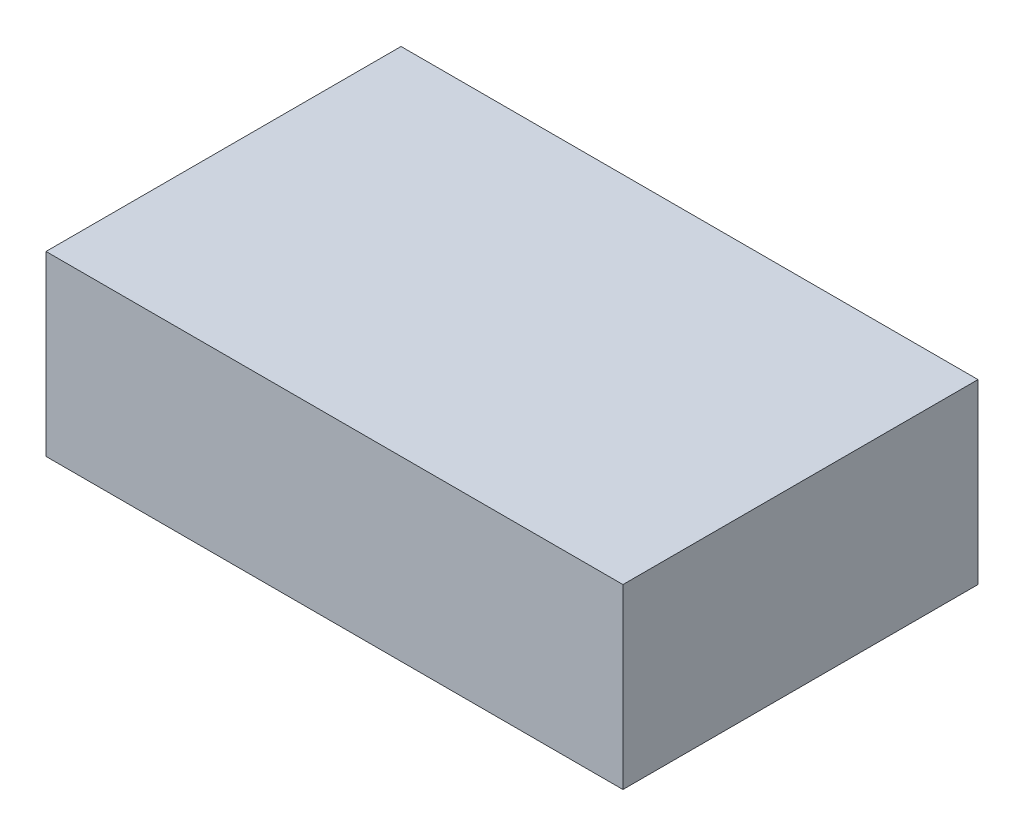
ISO-10303-21;
HEADER;
FILE_DESCRIPTION(('STEP AP214'),'2;1');
FILE_NAME('part.step','',(''),(''),'','','');
FILE_SCHEMA(('AUTOMOTIVE_DESIGN { 1 0 10303 214 1 1 1 1 }'));
ENDSEC;
DATA;
#1=APPLICATION_CONTEXT('core data for automotive mechanical design processes');
#2=APPLICATION_PROTOCOL_DEFINITION('international standard','automotive_design',2000,#1);
#3=PRODUCT_CONTEXT('',#1,'mechanical');
#4=PRODUCT('Part','Part','',(#3));
#5=PRODUCT_RELATED_PRODUCT_CATEGORY('part','',(#4));
#6=PRODUCT_DEFINITION_FORMATION('','',#4);
#7=PRODUCT_DEFINITION_CONTEXT('part definition',#1,'design');
#8=PRODUCT_DEFINITION('design','',#6,#7);
#9=PRODUCT_DEFINITION_SHAPE('','',#8);
#10=(LENGTH_UNIT() NAMED_UNIT(*) SI_UNIT(.MILLI.,.METRE.));
#11=(NAMED_UNIT(*) PLANE_ANGLE_UNIT() SI_UNIT($,.RADIAN.));
#12=(NAMED_UNIT(*) SI_UNIT($,.STERADIAN.) SOLID_ANGLE_UNIT());
#13=UNCERTAINTY_MEASURE_WITH_UNIT(LENGTH_MEASURE(1.E-05),#10,'distance_accuracy_value','');
#14=(GEOMETRIC_REPRESENTATION_CONTEXT(3) GLOBAL_UNCERTAINTY_ASSIGNED_CONTEXT((#13)) GLOBAL_UNIT_ASSIGNED_CONTEXT((#10,
#11,#12)) REPRESENTATION_CONTEXT('',''));
#15=CARTESIAN_POINT('',(0.,0.,0.));
#16=DIRECTION('',(0.,0.,1.));
#17=DIRECTION('',(1.,0.,0.));
#18=AXIS2_PLACEMENT_3D('',#15,#16,#17);
#19=CARTESIAN_POINT('',(0.,0.4,0.));
#20=DIRECTION('',(-1.,0.,0.));
#21=DIRECTION('',(0.,0.,1.));
#22=AXIS2_PLACEMENT_3D('',#19,#20,#21);
#23=PLANE('',#22);
#24=DIRECTION('',(0.,0.,-1.));
#25=VECTOR('',#24,1.);
#26=CARTESIAN_POINT('',(0.,0.,0.));
#27=LINE('',#26,#25);
#28=CARTESIAN_POINT('',(0.,0.,0.));
#29=VERTEX_POINT('',#28);
#30=CARTESIAN_POINT('',(0.,0.,-0.8));
#31=VERTEX_POINT('',#30);
#32=EDGE_CURVE('E110',#29,#31,#27,.T.);
#33=ORIENTED_EDGE('',*,*,#32,.F.);
#34=DIRECTION('',(0.,-1.,0.));
#35=VECTOR('',#34,1.);
#36=CARTESIAN_POINT('',(0.,0.4,0.));
#37=LINE('',#36,#35);
#38=CARTESIAN_POINT('',(0.,0.4,0.));
#39=VERTEX_POINT('',#38);
#40=EDGE_CURVE('E11',#39,#29,#37,.T.);
#41=ORIENTED_EDGE('',*,*,#40,.F.);
#42=DIRECTION('',(0.,0.,-1.));
#43=VECTOR('',#42,1.);
#44=CARTESIAN_POINT('',(0.,0.4,0.));
#45=LINE('',#44,#43);
#46=CARTESIAN_POINT('',(0.,0.4,-0.8));
#47=VERTEX_POINT('',#46);
#48=EDGE_CURVE('E103',#39,#47,#45,.T.);
#49=ORIENTED_EDGE('',*,*,#48,.T.);
#50=DIRECTION('',(0.,-1.,0.));
#51=VECTOR('',#50,1.);
#52=CARTESIAN_POINT('',(0.,0.4,-0.8));
#53=LINE('',#52,#51);
#54=EDGE_CURVE('E42',#47,#31,#53,.T.);
#55=ORIENTED_EDGE('',*,*,#54,.T.);
#56=EDGE_LOOP('',(#33,#41,#49,#55));
#57=FACE_BOUND('',#56,.T.);
#58=ADVANCED_FACE('F39',(#57),#23,.T.);
#59=CARTESIAN_POINT('',(0.,0.4,0.));
#60=DIRECTION('',(0.,0.,-1.));
#61=DIRECTION('',(-1.,0.,0.));
#62=AXIS2_PLACEMENT_3D('',#59,#60,#61);
#63=PLANE('',#62);
#64=DIRECTION('',(1.,0.,0.));
#65=VECTOR('',#64,1.);
#66=CARTESIAN_POINT('',(0.,0.,0.));
#67=LINE('',#66,#65);
#68=CARTESIAN_POINT('',(1.3,0.,0.));
#69=VERTEX_POINT('',#68);
#70=EDGE_CURVE('E73',#29,#69,#67,.T.);
#71=ORIENTED_EDGE('',*,*,#70,.T.);
#72=DIRECTION('',(0.,-1.,0.));
#73=VECTOR('',#72,1.);
#74=CARTESIAN_POINT('',(1.3,0.4,0.));
#75=LINE('',#74,#73);
#76=CARTESIAN_POINT('',(1.3,0.4,0.));
#77=VERTEX_POINT('',#76);
#78=EDGE_CURVE('E49',#77,#69,#75,.T.);
#79=ORIENTED_EDGE('',*,*,#78,.F.);
#80=DIRECTION('',(1.,0.,0.));
#81=VECTOR('',#80,1.);
#82=CARTESIAN_POINT('',(0.,0.4,0.));
#83=LINE('',#82,#81);
#84=EDGE_CURVE('E90',#39,#77,#83,.T.);
#85=ORIENTED_EDGE('',*,*,#84,.F.);
#86=ORIENTED_EDGE('',*,*,#40,.T.);
#87=EDGE_LOOP('',(#71,#79,#85,#86));
#88=FACE_BOUND('',#87,.T.);
#89=ADVANCED_FACE('F126',(#88),#63,.F.);
#90=CARTESIAN_POINT('',(1.3,0.4,0.));
#91=DIRECTION('',(-1.,0.,0.));
#92=DIRECTION('',(0.,0.,1.));
#93=AXIS2_PLACEMENT_3D('',#90,#91,#92);
#94=PLANE('',#93);
#95=DIRECTION('',(0.,0.,-1.));
#96=VECTOR('',#95,1.);
#97=CARTESIAN_POINT('',(1.3,0.,0.));
#98=LINE('',#97,#96);
#99=CARTESIAN_POINT('',(1.3,0.,-0.8));
#100=VERTEX_POINT('',#99);
#101=EDGE_CURVE('E98',#69,#100,#98,.T.);
#102=ORIENTED_EDGE('',*,*,#101,.T.);
#103=DIRECTION('',(0.,-1.,0.));
#104=VECTOR('',#103,1.);
#105=CARTESIAN_POINT('',(1.3,0.4,-0.8));
#106=LINE('',#105,#104);
#107=CARTESIAN_POINT('',(1.3,0.4,-0.8));
#108=VERTEX_POINT('',#107);
#109=EDGE_CURVE('E95',#108,#100,#106,.T.);
#110=ORIENTED_EDGE('',*,*,#109,.F.);
#111=DIRECTION('',(0.,0.,-1.));
#112=VECTOR('',#111,1.);
#113=CARTESIAN_POINT('',(1.3,0.4,0.));
#114=LINE('',#113,#112);
#115=EDGE_CURVE('E85',#77,#108,#114,.T.);
#116=ORIENTED_EDGE('',*,*,#115,.F.);
#117=ORIENTED_EDGE('',*,*,#78,.T.);
#118=EDGE_LOOP('',(#102,#110,#116,#117));
#119=FACE_BOUND('',#118,.T.);
#120=ADVANCED_FACE('F96',(#119),#94,.F.);
#121=CARTESIAN_POINT('',(0.,0.4,-0.8));
#122=DIRECTION('',(0.,0.,-1.));
#123=DIRECTION('',(-1.,0.,0.));
#124=AXIS2_PLACEMENT_3D('',#121,#122,#123);
#125=PLANE('',#124);
#126=DIRECTION('',(1.,0.,0.));
#127=VECTOR('',#126,1.);
#128=CARTESIAN_POINT('',(0.,0.,-0.8));
#129=LINE('',#128,#127);
#130=EDGE_CURVE('E114',#31,#100,#129,.T.);
#131=ORIENTED_EDGE('',*,*,#130,.F.);
#132=ORIENTED_EDGE('',*,*,#54,.F.);
#133=DIRECTION('',(1.,0.,0.));
#134=VECTOR('',#133,1.);
#135=CARTESIAN_POINT('',(0.,0.4,-0.8));
#136=LINE('',#135,#134);
#137=EDGE_CURVE('E89',#47,#108,#136,.T.);
#138=ORIENTED_EDGE('',*,*,#137,.T.);
#139=ORIENTED_EDGE('',*,*,#109,.T.);
#140=EDGE_LOOP('',(#131,#132,#138,#139));
#141=FACE_BOUND('',#140,.T.);
#142=ADVANCED_FACE('F101',(#141),#125,.T.);
#143=CARTESIAN_POINT('',(0.,0.4,0.));
#144=DIRECTION('',(0.,-1.,0.));
#145=DIRECTION('',(0.,0.,-1.));
#146=AXIS2_PLACEMENT_3D('',#143,#144,#145);
#147=PLANE('',#146);
#148=ORIENTED_EDGE('',*,*,#48,.F.);
#149=ORIENTED_EDGE('',*,*,#84,.T.);
#150=ORIENTED_EDGE('',*,*,#115,.T.);
#151=ORIENTED_EDGE('',*,*,#137,.F.);
#152=EDGE_LOOP('',(#148,#149,#150,#151));
#153=FACE_BOUND('',#152,.T.);
#154=ADVANCED_FACE('F88',(#153),#147,.F.);
#155=CARTESIAN_POINT('',(0.,0.,0.));
#156=DIRECTION('',(0.,-1.,0.));
#157=DIRECTION('',(0.,0.,-1.));
#158=AXIS2_PLACEMENT_3D('',#155,#156,#157);
#159=PLANE('',#158);
#160=ORIENTED_EDGE('',*,*,#32,.T.);
#161=ORIENTED_EDGE('',*,*,#130,.T.);
#162=ORIENTED_EDGE('',*,*,#101,.F.);
#163=ORIENTED_EDGE('',*,*,#70,.F.);
#164=EDGE_LOOP('',(#160,#161,#162,#163));
#165=FACE_BOUND('',#164,.T.);
#166=ADVANCED_FACE('F123',(#165),#159,.T.);
#167=CLOSED_SHELL('',(#58,#89,#120,#142,#154,#166));
#168=MANIFOLD_SOLID_BREP('B2',#167);
#169=ADVANCED_BREP_SHAPE_REPRESENTATION('',(#18,#168),#14);
#170=SHAPE_DEFINITION_REPRESENTATION(#9,#169);
ENDSEC;
END-ISO-10303-21;
